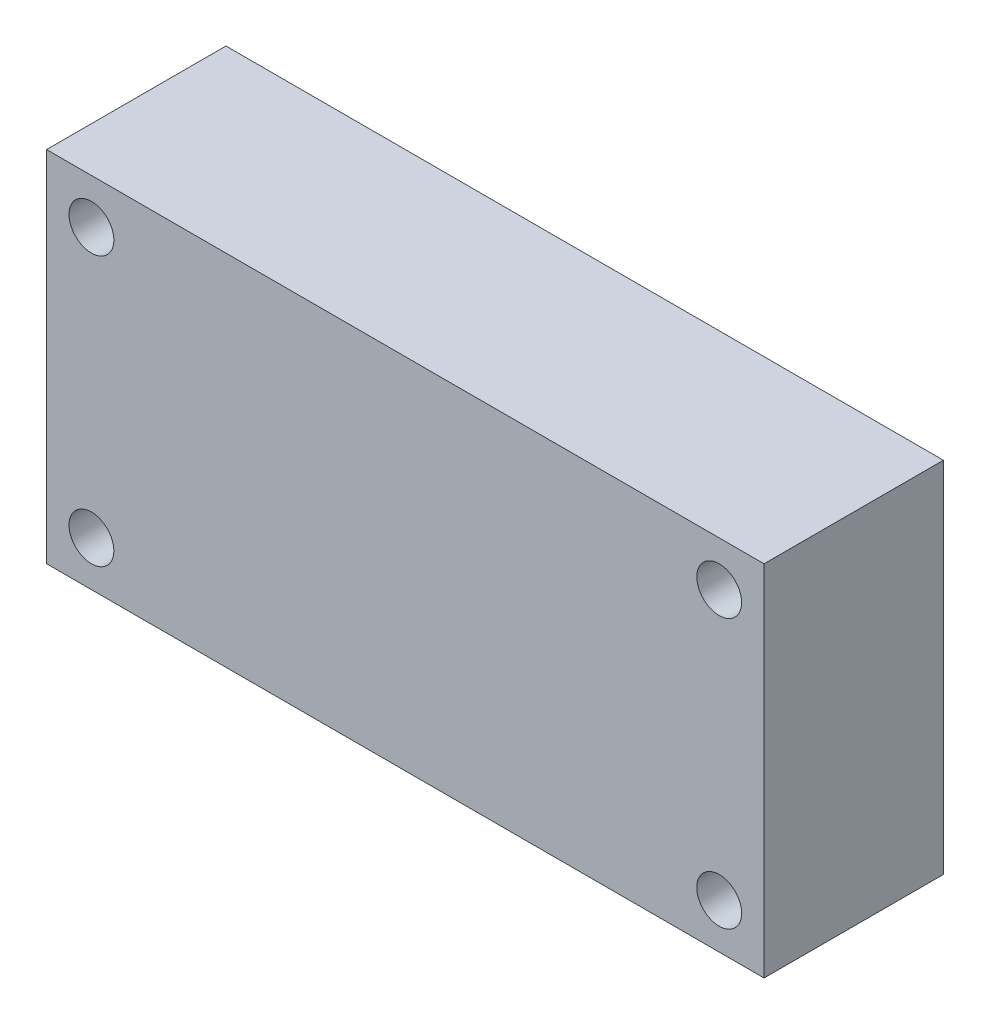
ISO-10303-21;
HEADER;
FILE_DESCRIPTION(('STEP AP214'),'2;1');
FILE_NAME('part.step','',(''),(''),'','','');
FILE_SCHEMA(('AUTOMOTIVE_DESIGN { 1 0 10303 214 1 1 1 1 }'));
ENDSEC;
DATA;
#1=APPLICATION_CONTEXT('core data for automotive mechanical design processes');
#2=APPLICATION_PROTOCOL_DEFINITION('international standard','automotive_design',2000,#1);
#3=PRODUCT_CONTEXT('',#1,'mechanical');
#4=PRODUCT('Part','Part','',(#3));
#5=PRODUCT_RELATED_PRODUCT_CATEGORY('part','',(#4));
#6=PRODUCT_DEFINITION_FORMATION('','',#4);
#7=PRODUCT_DEFINITION_CONTEXT('part definition',#1,'design');
#8=PRODUCT_DEFINITION('design','',#6,#7);
#9=PRODUCT_DEFINITION_SHAPE('','',#8);
#10=(LENGTH_UNIT() NAMED_UNIT(*) SI_UNIT(.MILLI.,.METRE.));
#11=(NAMED_UNIT(*) PLANE_ANGLE_UNIT() SI_UNIT($,.RADIAN.));
#12=(NAMED_UNIT(*) SI_UNIT($,.STERADIAN.) SOLID_ANGLE_UNIT());
#13=UNCERTAINTY_MEASURE_WITH_UNIT(LENGTH_MEASURE(1.E-05),#10,'distance_accuracy_value','');
#14=(GEOMETRIC_REPRESENTATION_CONTEXT(3) GLOBAL_UNCERTAINTY_ASSIGNED_CONTEXT((#13)) GLOBAL_UNIT_ASSIGNED_CONTEXT((#10,
#11,#12)) REPRESENTATION_CONTEXT('',''));
#15=CARTESIAN_POINT('',(0.,0.,0.));
#16=DIRECTION('',(0.,0.,1.));
#17=DIRECTION('',(1.,0.,0.));
#18=AXIS2_PLACEMENT_3D('',#15,#16,#17);
#19=CARTESIAN_POINT('',(-50.8,-25.4,-25.4));
#20=DIRECTION('',(-1.,0.,0.));
#21=DIRECTION('',(0.,0.,1.));
#22=AXIS2_PLACEMENT_3D('',#19,#20,#21);
#23=PLANE('',#22);
#24=DIRECTION('',(0.,-1.,0.));
#25=VECTOR('',#24,1.);
#26=CARTESIAN_POINT('',(-50.8,-25.4,0.));
#27=LINE('',#26,#25);
#28=CARTESIAN_POINT('',(-50.8,25.4,0.));
#29=VERTEX_POINT('',#28);
#30=CARTESIAN_POINT('',(-50.8,-25.4,0.));
#31=VERTEX_POINT('',#30);
#32=EDGE_CURVE('E98',#29,#31,#27,.T.);
#33=ORIENTED_EDGE('',*,*,#32,.F.);
#34=DIRECTION('',(0.,0.,1.));
#35=VECTOR('',#34,1.);
#36=CARTESIAN_POINT('',(-50.8,25.4,-25.4));
#37=LINE('',#36,#35);
#38=CARTESIAN_POINT('',(-50.8,25.4,-25.4));
#39=VERTEX_POINT('',#38);
#40=EDGE_CURVE('E11',#39,#29,#37,.T.);
#41=ORIENTED_EDGE('',*,*,#40,.F.);
#42=DIRECTION('',(0.,-1.,0.));
#43=VECTOR('',#42,1.);
#44=CARTESIAN_POINT('',(-50.8,-25.4,-25.4));
#45=LINE('',#44,#43);
#46=CARTESIAN_POINT('',(-50.8,-25.4,-25.4));
#47=VERTEX_POINT('',#46);
#48=EDGE_CURVE('E91',#39,#47,#45,.T.);
#49=ORIENTED_EDGE('',*,*,#48,.T.);
#50=DIRECTION('',(0.,0.,1.));
#51=VECTOR('',#50,1.);
#52=CARTESIAN_POINT('',(-50.8,-25.4,-25.4));
#53=LINE('',#52,#51);
#54=EDGE_CURVE('E36',#47,#31,#53,.T.);
#55=ORIENTED_EDGE('',*,*,#54,.T.);
#56=EDGE_LOOP('',(#33,#41,#49,#55));
#57=FACE_BOUND('',#56,.T.);
#58=ADVANCED_FACE('F33',(#57),#23,.T.);
#59=CARTESIAN_POINT('',(50.8,25.4,-25.4));
#60=DIRECTION('',(0.,1.,0.));
#61=DIRECTION('',(-1.,0.,0.));
#62=AXIS2_PLACEMENT_3D('',#59,#60,#61);
#63=PLANE('',#62);
#64=DIRECTION('',(-1.,0.,0.));
#65=VECTOR('',#64,1.);
#66=CARTESIAN_POINT('',(50.8,25.4,0.));
#67=LINE('',#66,#65);
#68=CARTESIAN_POINT('',(50.8,25.4,0.));
#69=VERTEX_POINT('',#68);
#70=EDGE_CURVE('E93',#69,#29,#67,.T.);
#71=ORIENTED_EDGE('',*,*,#70,.F.);
#72=DIRECTION('',(0.,0.,1.));
#73=VECTOR('',#72,1.);
#74=CARTESIAN_POINT('',(50.8,25.4,-25.4));
#75=LINE('',#74,#73);
#76=CARTESIAN_POINT('',(50.8,25.4,-25.4));
#77=VERTEX_POINT('',#76);
#78=EDGE_CURVE('E42',#77,#69,#75,.T.);
#79=ORIENTED_EDGE('',*,*,#78,.F.);
#80=DIRECTION('',(-1.,0.,0.));
#81=VECTOR('',#80,1.);
#82=CARTESIAN_POINT('',(50.8,25.4,-25.4));
#83=LINE('',#82,#81);
#84=EDGE_CURVE('E88',#77,#39,#83,.T.);
#85=ORIENTED_EDGE('',*,*,#84,.T.);
#86=ORIENTED_EDGE('',*,*,#40,.T.);
#87=EDGE_LOOP('',(#71,#79,#85,#86));
#88=FACE_BOUND('',#87,.T.);
#89=ADVANCED_FACE('F109',(#88),#63,.T.);
#90=CARTESIAN_POINT('',(50.8,-25.4,-25.4));
#91=DIRECTION('',(1.,0.,0.));
#92=DIRECTION('',(0.,0.,-1.));
#93=AXIS2_PLACEMENT_3D('',#90,#91,#92);
#94=PLANE('',#93);
#95=DIRECTION('',(0.,1.,0.));
#96=VECTOR('',#95,1.);
#97=CARTESIAN_POINT('',(50.8,-25.4,0.));
#98=LINE('',#97,#96);
#99=CARTESIAN_POINT('',(50.8,-25.4,0.));
#100=VERTEX_POINT('',#99);
#101=EDGE_CURVE('E83',#100,#69,#98,.T.);
#102=ORIENTED_EDGE('',*,*,#101,.F.);
#103=DIRECTION('',(0.,0.,1.));
#104=VECTOR('',#103,1.);
#105=CARTESIAN_POINT('',(50.8,-25.4,-25.4));
#106=LINE('',#105,#104);
#107=CARTESIAN_POINT('',(50.8,-25.4,-25.4));
#108=VERTEX_POINT('',#107);
#109=EDGE_CURVE('E78',#108,#100,#106,.T.);
#110=ORIENTED_EDGE('',*,*,#109,.F.);
#111=DIRECTION('',(0.,1.,0.));
#112=VECTOR('',#111,1.);
#113=CARTESIAN_POINT('',(50.8,-25.4,-25.4));
#114=LINE('',#113,#112);
#115=EDGE_CURVE('E81',#108,#77,#114,.T.);
#116=ORIENTED_EDGE('',*,*,#115,.T.);
#117=ORIENTED_EDGE('',*,*,#78,.T.);
#118=EDGE_LOOP('',(#102,#110,#116,#117));
#119=FACE_BOUND('',#118,.T.);
#120=ADVANCED_FACE('F80',(#119),#94,.T.);
#121=CARTESIAN_POINT('',(50.8,-25.4,-25.4));
#122=DIRECTION('',(0.,-1.,0.));
#123=DIRECTION('',(1.,0.,0.));
#124=AXIS2_PLACEMENT_3D('',#121,#122,#123);
#125=PLANE('',#124);
#126=DIRECTION('',(1.,0.,0.));
#127=VECTOR('',#126,1.);
#128=CARTESIAN_POINT('',(50.8,-25.4,0.));
#129=LINE('',#128,#127);
#130=EDGE_CURVE('E101',#31,#100,#129,.T.);
#131=ORIENTED_EDGE('',*,*,#130,.F.);
#132=ORIENTED_EDGE('',*,*,#54,.F.);
#133=DIRECTION('',(1.,0.,0.));
#134=VECTOR('',#133,1.);
#135=CARTESIAN_POINT('',(50.8,-25.4,-25.4));
#136=LINE('',#135,#134);
#137=EDGE_CURVE('E87',#47,#108,#136,.T.);
#138=ORIENTED_EDGE('',*,*,#137,.T.);
#139=ORIENTED_EDGE('',*,*,#109,.T.);
#140=EDGE_LOOP('',(#131,#132,#138,#139));
#141=FACE_BOUND('',#140,.T.);
#142=ADVANCED_FACE('F90',(#141),#125,.T.);
#143=CARTESIAN_POINT('',(0.,0.,-25.4));
#144=DIRECTION('',(0.,0.,1.));
#145=DIRECTION('',(1.,0.,0.));
#146=AXIS2_PLACEMENT_3D('',#143,#144,#145);
#147=PLANE('',#146);
#148=CARTESIAN_POINT('',(44.45,-19.05,-25.4));
#149=DIRECTION('',(0.,0.,1.));
#150=DIRECTION('',(1.,0.,0.));
#151=AXIS2_PLACEMENT_3D('',#148,#149,#150);
#152=CIRCLE('',#151,3.175);
#153=CARTESIAN_POINT('',(47.625,-19.05,-25.4));
#154=VERTEX_POINT('',#153);
#155=EDGE_CURVE('E150',#154,#154,#152,.T.);
#156=ORIENTED_EDGE('',*,*,#155,.T.);
#157=EDGE_LOOP('',(#156));
#158=FACE_BOUND('',#157,.T.);
#159=CARTESIAN_POINT('',(-44.45,19.05,-25.4));
#160=DIRECTION('',(0.,0.,1.));
#161=DIRECTION('',(1.,0.,0.));
#162=AXIS2_PLACEMENT_3D('',#159,#160,#161);
#163=CIRCLE('',#162,3.175);
#164=CARTESIAN_POINT('',(-41.275,19.05,-25.4));
#165=VERTEX_POINT('',#164);
#166=EDGE_CURVE('E158',#165,#165,#163,.T.);
#167=ORIENTED_EDGE('',*,*,#166,.T.);
#168=EDGE_LOOP('',(#167));
#169=FACE_BOUND('',#168,.T.);
#170=CARTESIAN_POINT('',(-44.45,-19.05,-25.4));
#171=DIRECTION('',(0.,0.,1.));
#172=DIRECTION('',(1.,0.,0.));
#173=AXIS2_PLACEMENT_3D('',#170,#171,#172);
#174=CIRCLE('',#173,3.175);
#175=CARTESIAN_POINT('',(-41.275,-19.05,-25.4));
#176=VERTEX_POINT('',#175);
#177=EDGE_CURVE('E164',#176,#176,#174,.T.);
#178=ORIENTED_EDGE('',*,*,#177,.T.);
#179=EDGE_LOOP('',(#178));
#180=FACE_BOUND('',#179,.T.);
#181=CARTESIAN_POINT('',(44.45,19.05,-25.4));
#182=DIRECTION('',(0.,0.,1.));
#183=DIRECTION('',(1.,0.,0.));
#184=AXIS2_PLACEMENT_3D('',#181,#182,#183);
#185=CIRCLE('',#184,3.175);
#186=CARTESIAN_POINT('',(47.625,19.05,-25.4));
#187=VERTEX_POINT('',#186);
#188=EDGE_CURVE('E102',#187,#187,#185,.T.);
#189=ORIENTED_EDGE('',*,*,#188,.T.);
#190=EDGE_LOOP('',(#189));
#191=FACE_BOUND('',#190,.T.);
#192=ORIENTED_EDGE('',*,*,#48,.F.);
#193=ORIENTED_EDGE('',*,*,#84,.F.);
#194=ORIENTED_EDGE('',*,*,#115,.F.);
#195=ORIENTED_EDGE('',*,*,#137,.F.);
#196=EDGE_LOOP('',(#192,#193,#194,#195));
#197=FACE_BOUND('',#196,.T.);
#198=ADVANCED_FACE('F86',(#158,#169,#180,#191,#197),#147,.F.);
#199=CARTESIAN_POINT('',(0.,0.,0.));
#200=DIRECTION('',(0.,0.,1.));
#201=DIRECTION('',(1.,0.,0.));
#202=AXIS2_PLACEMENT_3D('',#199,#200,#201);
#203=PLANE('',#202);
#204=CARTESIAN_POINT('',(44.45,-19.05,0.));
#205=DIRECTION('',(0.,0.,1.));
#206=DIRECTION('',(1.,0.,0.));
#207=AXIS2_PLACEMENT_3D('',#204,#205,#206);
#208=CIRCLE('',#207,3.175);
#209=CARTESIAN_POINT('',(47.625,-19.05,0.));
#210=VERTEX_POINT('',#209);
#211=EDGE_CURVE('E153',#210,#210,#208,.T.);
#212=ORIENTED_EDGE('',*,*,#211,.F.);
#213=EDGE_LOOP('',(#212));
#214=FACE_BOUND('',#213,.T.);
#215=CARTESIAN_POINT('',(-44.45,19.05,0.));
#216=DIRECTION('',(0.,0.,1.));
#217=DIRECTION('',(1.,0.,0.));
#218=AXIS2_PLACEMENT_3D('',#215,#216,#217);
#219=CIRCLE('',#218,3.175);
#220=CARTESIAN_POINT('',(-41.275,19.05,0.));
#221=VERTEX_POINT('',#220);
#222=EDGE_CURVE('E155',#221,#221,#219,.T.);
#223=ORIENTED_EDGE('',*,*,#222,.F.);
#224=EDGE_LOOP('',(#223));
#225=FACE_BOUND('',#224,.T.);
#226=CARTESIAN_POINT('',(-44.45,-19.05,0.));
#227=DIRECTION('',(0.,0.,1.));
#228=DIRECTION('',(1.,0.,0.));
#229=AXIS2_PLACEMENT_3D('',#226,#227,#228);
#230=CIRCLE('',#229,3.175);
#231=CARTESIAN_POINT('',(-41.275,-19.05,0.));
#232=VERTEX_POINT('',#231);
#233=EDGE_CURVE('E161',#232,#232,#230,.T.);
#234=ORIENTED_EDGE('',*,*,#233,.F.);
#235=EDGE_LOOP('',(#234));
#236=FACE_BOUND('',#235,.T.);
#237=CARTESIAN_POINT('',(44.45,19.05,0.));
#238=DIRECTION('',(0.,0.,1.));
#239=DIRECTION('',(1.,0.,0.));
#240=AXIS2_PLACEMENT_3D('',#237,#238,#239);
#241=CIRCLE('',#240,3.175);
#242=CARTESIAN_POINT('',(47.625,19.05,0.));
#243=VERTEX_POINT('',#242);
#244=EDGE_CURVE('E167',#243,#243,#241,.T.);
#245=ORIENTED_EDGE('',*,*,#244,.F.);
#246=EDGE_LOOP('',(#245));
#247=FACE_BOUND('',#246,.T.);
#248=ORIENTED_EDGE('',*,*,#32,.T.);
#249=ORIENTED_EDGE('',*,*,#130,.T.);
#250=ORIENTED_EDGE('',*,*,#101,.T.);
#251=ORIENTED_EDGE('',*,*,#70,.T.);
#252=EDGE_LOOP('',(#248,#249,#250,#251));
#253=FACE_BOUND('',#252,.T.);
#254=ADVANCED_FACE('F108',(#214,#225,#236,#247,#253),#203,.T.);
#255=CARTESIAN_POINT('',(44.45,19.05,-25.4));
#256=DIRECTION('',(0.,0.,1.));
#257=DIRECTION('',(1.,0.,0.));
#258=AXIS2_PLACEMENT_3D('',#255,#256,#257);
#259=CYLINDRICAL_SURFACE('',#258,3.175);
#260=ORIENTED_EDGE('',*,*,#188,.F.);
#261=EDGE_LOOP('',(#260));
#262=FACE_BOUND('',#261,.T.);
#263=ORIENTED_EDGE('',*,*,#244,.T.);
#264=EDGE_LOOP('',(#263));
#265=FACE_BOUND('',#264,.T.);
#266=ADVANCED_FACE('F127',(#262,#265),#259,.F.);
#267=CARTESIAN_POINT('',(-44.45,-19.05,-25.4));
#268=DIRECTION('',(0.,0.,1.));
#269=DIRECTION('',(1.,0.,0.));
#270=AXIS2_PLACEMENT_3D('',#267,#268,#269);
#271=CYLINDRICAL_SURFACE('',#270,3.175);
#272=ORIENTED_EDGE('',*,*,#177,.F.);
#273=EDGE_LOOP('',(#272));
#274=FACE_BOUND('',#273,.T.);
#275=ORIENTED_EDGE('',*,*,#233,.T.);
#276=EDGE_LOOP('',(#275));
#277=FACE_BOUND('',#276,.T.);
#278=ADVANCED_FACE('F134',(#274,#277),#271,.F.);
#279=CARTESIAN_POINT('',(-44.45,19.05,-25.4));
#280=DIRECTION('',(0.,0.,1.));
#281=DIRECTION('',(1.,0.,0.));
#282=AXIS2_PLACEMENT_3D('',#279,#280,#281);
#283=CYLINDRICAL_SURFACE('',#282,3.175);
#284=ORIENTED_EDGE('',*,*,#166,.F.);
#285=EDGE_LOOP('',(#284));
#286=FACE_BOUND('',#285,.T.);
#287=ORIENTED_EDGE('',*,*,#222,.T.);
#288=EDGE_LOOP('',(#287));
#289=FACE_BOUND('',#288,.T.);
#290=ADVANCED_FACE('F138',(#286,#289),#283,.F.);
#291=CARTESIAN_POINT('',(44.45,-19.05,-25.4));
#292=DIRECTION('',(0.,0.,1.));
#293=DIRECTION('',(1.,0.,0.));
#294=AXIS2_PLACEMENT_3D('',#291,#292,#293);
#295=CYLINDRICAL_SURFACE('',#294,3.175);
#296=ORIENTED_EDGE('',*,*,#155,.F.);
#297=EDGE_LOOP('',(#296));
#298=FACE_BOUND('',#297,.T.);
#299=ORIENTED_EDGE('',*,*,#211,.T.);
#300=EDGE_LOOP('',(#299));
#301=FACE_BOUND('',#300,.T.);
#302=ADVANCED_FACE('F142',(#298,#301),#295,.F.);
#303=CLOSED_SHELL('',(#58,#89,#120,#142,#198,#254,#266,#278,#290,#302));
#304=MANIFOLD_SOLID_BREP('B2',#303);
#305=ADVANCED_BREP_SHAPE_REPRESENTATION('',(#18,#304),#14);
#306=SHAPE_DEFINITION_REPRESENTATION(#9,#305);
ENDSEC;
END-ISO-10303-21;
